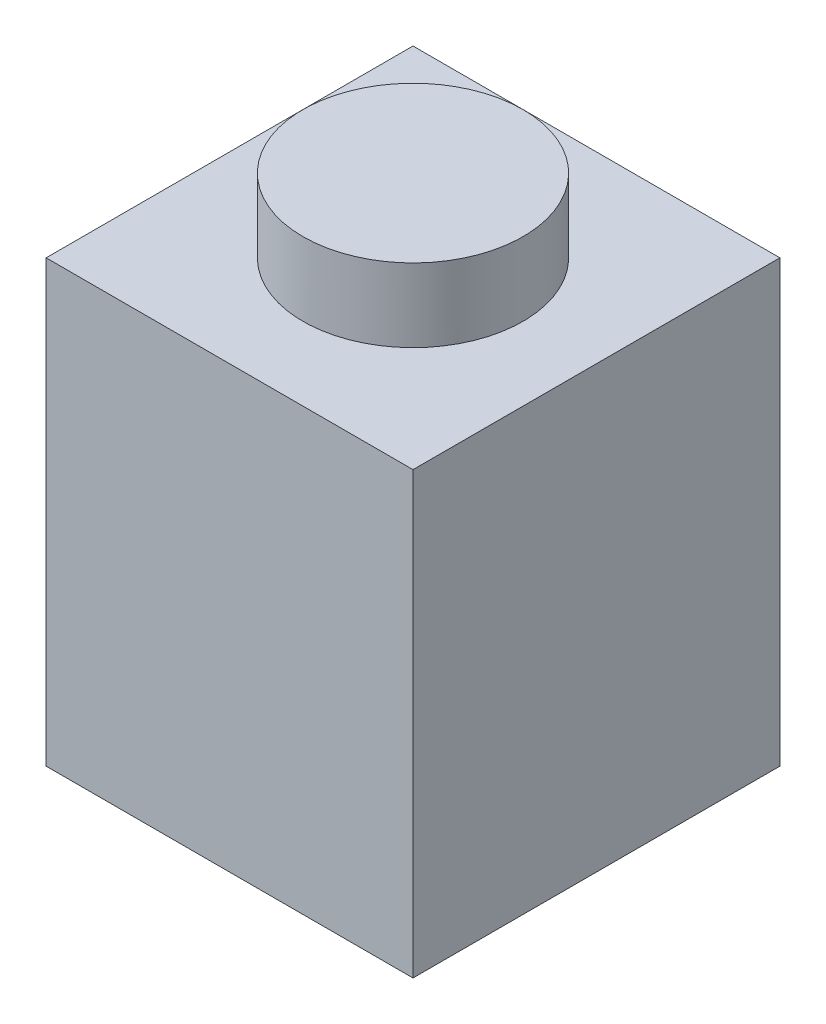
ISO-10303-21;
HEADER;
FILE_DESCRIPTION(('STEP AP214'),'2;1');
FILE_NAME('part.step','',(''),(''),'','','');
FILE_SCHEMA(('AUTOMOTIVE_DESIGN { 1 0 10303 214 1 1 1 1 }'));
ENDSEC;
DATA;
#1=APPLICATION_CONTEXT('core data for automotive mechanical design processes');
#2=APPLICATION_PROTOCOL_DEFINITION('international standard','automotive_design',2000,#1);
#3=PRODUCT_CONTEXT('',#1,'mechanical');
#4=PRODUCT('Part','Part','',(#3));
#5=PRODUCT_RELATED_PRODUCT_CATEGORY('part','',(#4));
#6=PRODUCT_DEFINITION_FORMATION('','',#4);
#7=PRODUCT_DEFINITION_CONTEXT('part definition',#1,'design');
#8=PRODUCT_DEFINITION('design','',#6,#7);
#9=PRODUCT_DEFINITION_SHAPE('','',#8);
#10=(LENGTH_UNIT() NAMED_UNIT(*) SI_UNIT(.MILLI.,.METRE.));
#11=(NAMED_UNIT(*) PLANE_ANGLE_UNIT() SI_UNIT($,.RADIAN.));
#12=(NAMED_UNIT(*) SI_UNIT($,.STERADIAN.) SOLID_ANGLE_UNIT());
#13=UNCERTAINTY_MEASURE_WITH_UNIT(LENGTH_MEASURE(1.E-05),#10,'distance_accuracy_value','');
#14=(GEOMETRIC_REPRESENTATION_CONTEXT(3) GLOBAL_UNCERTAINTY_ASSIGNED_CONTEXT((#13)) GLOBAL_UNIT_ASSIGNED_CONTEXT((#10,
#11,#12)) REPRESENTATION_CONTEXT('',''));
#15=CARTESIAN_POINT('',(0.,0.,0.));
#16=DIRECTION('',(0.,0.,1.));
#17=DIRECTION('',(1.,0.,0.));
#18=AXIS2_PLACEMENT_3D('',#15,#16,#17);
#19=CARTESIAN_POINT('',(1.,6.,-4.));
#20=DIRECTION('',(1.,0.,0.));
#21=DIRECTION('',(0.,0.,-1.));
#22=AXIS2_PLACEMENT_3D('',#19,#20,#21);
#23=PLANE('',#22);
#24=DIRECTION('',(0.,-1.,0.));
#25=VECTOR('',#24,1.);
#26=CARTESIAN_POINT('',(1.,6.,-4.));
#27=LINE('',#26,#25);
#28=CARTESIAN_POINT('',(1.,5.,-4.));
#29=VERTEX_POINT('',#28);
#30=CARTESIAN_POINT('',(1.,0.,-4.));
#31=VERTEX_POINT('',#30);
#32=EDGE_CURVE('E57',#29,#31,#27,.T.);
#33=ORIENTED_EDGE('',*,*,#32,.F.);
#34=DIRECTION('',(0.,0.,-1.));
#35=VECTOR('',#34,1.);
#36=CARTESIAN_POINT('',(1.,5.,500000.));
#37=LINE('',#36,#35);
#38=CARTESIAN_POINT('',(1.,5.,-0.999999999862666));
#39=VERTEX_POINT('',#38);
#40=EDGE_CURVE('E50',#39,#29,#37,.T.);
#41=ORIENTED_EDGE('',*,*,#40,.F.);
#42=DIRECTION('',(0.,-1.,0.));
#43=VECTOR('',#42,1.);
#44=CARTESIAN_POINT('',(1.,6.,-1.));
#45=LINE('',#44,#43);
#46=CARTESIAN_POINT('',(1.,0.,-1.));
#47=VERTEX_POINT('',#46);
#48=EDGE_CURVE('E109',#39,#47,#45,.T.);
#49=ORIENTED_EDGE('',*,*,#48,.T.);
#50=DIRECTION('',(0.,0.,1.));
#51=VECTOR('',#50,1.);
#52=CARTESIAN_POINT('',(1.,0.,-4.));
#53=LINE('',#52,#51);
#54=EDGE_CURVE('E224',#31,#47,#53,.T.);
#55=ORIENTED_EDGE('',*,*,#54,.F.);
#56=EDGE_LOOP('',(#33,#41,#49,#55));
#57=FACE_BOUND('',#56,.T.);
#58=ADVANCED_FACE('F35',(#57),#23,.T.);
#59=CARTESIAN_POINT('',(1.,6.,-1.));
#60=DIRECTION('',(0.,0.,-1.));
#61=DIRECTION('',(-1.,0.,0.));
#62=AXIS2_PLACEMENT_3D('',#59,#60,#61);
#63=PLANE('',#62);
#64=ORIENTED_EDGE('',*,*,#48,.F.);
#65=DIRECTION('',(-1.,0.,0.));
#66=VECTOR('',#65,1.);
#67=CARTESIAN_POINT('',(1.,5.,-0.999999999976353));
#68=LINE('',#67,#66);
#69=CARTESIAN_POINT('',(4.,5.,-0.999999999862666));
#70=VERTEX_POINT('',#69);
#71=EDGE_CURVE('E99',#70,#39,#68,.T.);
#72=ORIENTED_EDGE('',*,*,#71,.F.);
#73=DIRECTION('',(0.,-1.,0.));
#74=VECTOR('',#73,1.);
#75=CARTESIAN_POINT('',(4.,6.,-1.));
#76=LINE('',#75,#74);
#77=CARTESIAN_POINT('',(4.,0.,-1.));
#78=VERTEX_POINT('',#77);
#79=EDGE_CURVE('E117',#70,#78,#76,.T.);
#80=ORIENTED_EDGE('',*,*,#79,.T.);
#81=DIRECTION('',(1.,0.,0.));
#82=VECTOR('',#81,1.);
#83=CARTESIAN_POINT('',(1.,0.,-1.));
#84=LINE('',#83,#82);
#85=EDGE_CURVE('E114',#47,#78,#84,.T.);
#86=ORIENTED_EDGE('',*,*,#85,.F.);
#87=EDGE_LOOP('',(#64,#72,#80,#86));
#88=FACE_BOUND('',#87,.T.);
#89=ADVANCED_FACE('F112',(#88),#63,.T.);
#90=CARTESIAN_POINT('',(4.,6.,-4.));
#91=DIRECTION('',(-1.,0.,0.));
#92=DIRECTION('',(0.,0.,1.));
#93=AXIS2_PLACEMENT_3D('',#90,#91,#92);
#94=PLANE('',#93);
#95=ORIENTED_EDGE('',*,*,#79,.F.);
#96=DIRECTION('',(0.,0.,-1.));
#97=VECTOR('',#96,1.);
#98=CARTESIAN_POINT('',(4.,5.,500000.));
#99=LINE('',#98,#97);
#100=CARTESIAN_POINT('',(4.,5.,-4.));
#101=VERTEX_POINT('',#100);
#102=EDGE_CURVE('E102',#70,#101,#99,.T.);
#103=ORIENTED_EDGE('',*,*,#102,.T.);
#104=DIRECTION('',(0.,-1.,0.));
#105=VECTOR('',#104,1.);
#106=CARTESIAN_POINT('',(4.,6.,-4.));
#107=LINE('',#106,#105);
#108=CARTESIAN_POINT('',(4.,0.,-4.));
#109=VERTEX_POINT('',#108);
#110=EDGE_CURVE('E122',#101,#109,#107,.T.);
#111=ORIENTED_EDGE('',*,*,#110,.T.);
#112=DIRECTION('',(0.,0.,-1.));
#113=VECTOR('',#112,1.);
#114=CARTESIAN_POINT('',(4.,0.,-4.));
#115=LINE('',#114,#113);
#116=EDGE_CURVE('E229',#78,#109,#115,.T.);
#117=ORIENTED_EDGE('',*,*,#116,.F.);
#118=EDGE_LOOP('',(#95,#103,#111,#117));
#119=FACE_BOUND('',#118,.T.);
#120=ADVANCED_FACE('F180',(#119),#94,.T.);
#121=CARTESIAN_POINT('',(1.,6.,-4.));
#122=DIRECTION('',(0.,0.,1.));
#123=DIRECTION('',(1.,0.,0.));
#124=AXIS2_PLACEMENT_3D('',#121,#122,#123);
#125=PLANE('',#124);
#126=ORIENTED_EDGE('',*,*,#110,.F.);
#127=DIRECTION('',(1.,0.,0.));
#128=VECTOR('',#127,1.);
#129=CARTESIAN_POINT('',(1.,5.,-4.));
#130=LINE('',#129,#128);
#131=EDGE_CURVE('E223',#29,#101,#130,.T.);
#132=ORIENTED_EDGE('',*,*,#131,.F.);
#133=ORIENTED_EDGE('',*,*,#32,.T.);
#134=DIRECTION('',(-1.,0.,0.));
#135=VECTOR('',#134,1.);
#136=CARTESIAN_POINT('',(1.,0.,-4.));
#137=LINE('',#136,#135);
#138=EDGE_CURVE('E232',#109,#31,#137,.T.);
#139=ORIENTED_EDGE('',*,*,#138,.F.);
#140=EDGE_LOOP('',(#126,#132,#133,#139));
#141=FACE_BOUND('',#140,.T.);
#142=ADVANCED_FACE('F172',(#141),#125,.T.);
#143=CARTESIAN_POINT('',(0.,6.,0.));
#144=DIRECTION('',(0.,-1.,0.));
#145=DIRECTION('',(0.,0.,-1.));
#146=AXIS2_PLACEMENT_3D('',#143,#144,#145);
#147=PLANE('',#146);
#148=CARTESIAN_POINT('',(2.5,6.,-2.5));
#149=DIRECTION('',(0.,-1.,0.));
#150=DIRECTION('',(0.,0.,-1.));
#151=AXIS2_PLACEMENT_3D('',#148,#149,#150);
#152=CIRCLE('',#151,1.5);
#153=CARTESIAN_POINT('',(2.5,6.,-4.));
#154=VERTEX_POINT('',#153);
#155=EDGE_CURVE('E11',#154,#154,#152,.F.);
#156=ORIENTED_EDGE('',*,*,#155,.F.);
#157=EDGE_LOOP('',(#156));
#158=FACE_BOUND('',#157,.T.);
#159=DIRECTION('',(0.,0.,1.));
#160=VECTOR('',#159,1.);
#161=CARTESIAN_POINT('',(0.,6.,0.));
#162=LINE('',#161,#160);
#163=CARTESIAN_POINT('',(0.,6.,-5.));
#164=VERTEX_POINT('',#163);
#165=CARTESIAN_POINT('',(0.,6.,0.));
#166=VERTEX_POINT('',#165);
#167=EDGE_CURVE('E126',#164,#166,#162,.T.);
#168=ORIENTED_EDGE('',*,*,#167,.T.);
#169=DIRECTION('',(1.,0.,0.));
#170=VECTOR('',#169,1.);
#171=CARTESIAN_POINT('',(0.,6.,0.));
#172=LINE('',#171,#170);
#173=CARTESIAN_POINT('',(5.,6.,0.));
#174=VERTEX_POINT('',#173);
#175=EDGE_CURVE('E129',#166,#174,#172,.T.);
#176=ORIENTED_EDGE('',*,*,#175,.T.);
#177=DIRECTION('',(0.,0.,-1.));
#178=VECTOR('',#177,1.);
#179=CARTESIAN_POINT('',(5.,6.,0.));
#180=LINE('',#179,#178);
#181=CARTESIAN_POINT('',(5.,6.,-5.));
#182=VERTEX_POINT('',#181);
#183=EDGE_CURVE('E132',#174,#182,#180,.T.);
#184=ORIENTED_EDGE('',*,*,#183,.T.);
#185=DIRECTION('',(-1.,0.,0.));
#186=VECTOR('',#185,1.);
#187=CARTESIAN_POINT('',(0.,6.,-5.));
#188=LINE('',#187,#186);
#189=EDGE_CURVE('E134',#182,#164,#188,.T.);
#190=ORIENTED_EDGE('',*,*,#189,.T.);
#191=EDGE_LOOP('',(#168,#176,#184,#190));
#192=FACE_BOUND('',#191,.T.);
#193=ADVANCED_FACE('F170',(#158,#192),#147,.F.);
#194=CARTESIAN_POINT('',(0.,0.,0.));
#195=DIRECTION('',(0.,-1.,0.));
#196=DIRECTION('',(0.,0.,-1.));
#197=AXIS2_PLACEMENT_3D('',#194,#195,#196);
#198=PLANE('',#197);
#199=DIRECTION('',(0.,0.,1.));
#200=VECTOR('',#199,1.);
#201=CARTESIAN_POINT('',(0.,0.,0.));
#202=LINE('',#201,#200);
#203=CARTESIAN_POINT('',(0.,0.,-5.));
#204=VERTEX_POINT('',#203);
#205=CARTESIAN_POINT('',(0.,0.,0.));
#206=VERTEX_POINT('',#205);
#207=EDGE_CURVE('E116',#204,#206,#202,.T.);
#208=ORIENTED_EDGE('',*,*,#207,.F.);
#209=DIRECTION('',(-1.,0.,0.));
#210=VECTOR('',#209,1.);
#211=CARTESIAN_POINT('',(0.,0.,-5.));
#212=LINE('',#211,#210);
#213=CARTESIAN_POINT('',(5.,0.,-5.));
#214=VERTEX_POINT('',#213);
#215=EDGE_CURVE('E130',#214,#204,#212,.T.);
#216=ORIENTED_EDGE('',*,*,#215,.F.);
#217=DIRECTION('',(0.,0.,-1.));
#218=VECTOR('',#217,1.);
#219=CARTESIAN_POINT('',(5.,0.,0.));
#220=LINE('',#219,#218);
#221=CARTESIAN_POINT('',(5.,0.,0.));
#222=VERTEX_POINT('',#221);
#223=EDGE_CURVE('E138',#222,#214,#220,.T.);
#224=ORIENTED_EDGE('',*,*,#223,.F.);
#225=DIRECTION('',(1.,0.,0.));
#226=VECTOR('',#225,1.);
#227=CARTESIAN_POINT('',(0.,0.,0.));
#228=LINE('',#227,#226);
#229=EDGE_CURVE('E120',#206,#222,#228,.T.);
#230=ORIENTED_EDGE('',*,*,#229,.F.);
#231=EDGE_LOOP('',(#208,#216,#224,#230));
#232=FACE_BOUND('',#231,.T.);
#233=ORIENTED_EDGE('',*,*,#138,.T.);
#234=ORIENTED_EDGE('',*,*,#54,.T.);
#235=ORIENTED_EDGE('',*,*,#85,.T.);
#236=ORIENTED_EDGE('',*,*,#116,.T.);
#237=EDGE_LOOP('',(#233,#234,#235,#236));
#238=FACE_BOUND('',#237,.T.);
#239=ADVANCED_FACE('F159',(#232,#238),#198,.T.);
#240=CARTESIAN_POINT('',(0.,6.,0.));
#241=DIRECTION('',(1.,0.,0.));
#242=DIRECTION('',(0.,0.,-1.));
#243=AXIS2_PLACEMENT_3D('',#240,#241,#242);
#244=PLANE('',#243);
#245=ORIENTED_EDGE('',*,*,#207,.T.);
#246=DIRECTION('',(0.,-1.,0.));
#247=VECTOR('',#246,1.);
#248=CARTESIAN_POINT('',(0.,6.,0.));
#249=LINE('',#248,#247);
#250=EDGE_CURVE('E43',#166,#206,#249,.T.);
#251=ORIENTED_EDGE('',*,*,#250,.F.);
#252=ORIENTED_EDGE('',*,*,#167,.F.);
#253=DIRECTION('',(0.,-1.,0.));
#254=VECTOR('',#253,1.);
#255=CARTESIAN_POINT('',(0.,6.,-5.));
#256=LINE('',#255,#254);
#257=EDGE_CURVE('E135',#164,#204,#256,.T.);
#258=ORIENTED_EDGE('',*,*,#257,.T.);
#259=EDGE_LOOP('',(#245,#251,#252,#258));
#260=FACE_BOUND('',#259,.T.);
#261=ADVANCED_FACE('F37',(#260),#244,.F.);
#262=CARTESIAN_POINT('',(0.,6.,0.));
#263=DIRECTION('',(0.,0.,-1.));
#264=DIRECTION('',(-1.,0.,0.));
#265=AXIS2_PLACEMENT_3D('',#262,#263,#264);
#266=PLANE('',#265);
#267=ORIENTED_EDGE('',*,*,#229,.T.);
#268=DIRECTION('',(0.,-1.,0.));
#269=VECTOR('',#268,1.);
#270=CARTESIAN_POINT('',(5.,6.,0.));
#271=LINE('',#270,#269);
#272=EDGE_CURVE('E146',#174,#222,#271,.T.);
#273=ORIENTED_EDGE('',*,*,#272,.F.);
#274=ORIENTED_EDGE('',*,*,#175,.F.);
#275=ORIENTED_EDGE('',*,*,#250,.T.);
#276=EDGE_LOOP('',(#267,#273,#274,#275));
#277=FACE_BOUND('',#276,.T.);
#278=ADVANCED_FACE('F151',(#277),#266,.F.);
#279=CARTESIAN_POINT('',(5.,6.,0.));
#280=DIRECTION('',(-1.,0.,0.));
#281=DIRECTION('',(0.,0.,1.));
#282=AXIS2_PLACEMENT_3D('',#279,#280,#281);
#283=PLANE('',#282);
#284=ORIENTED_EDGE('',*,*,#223,.T.);
#285=DIRECTION('',(0.,-1.,0.));
#286=VECTOR('',#285,1.);
#287=CARTESIAN_POINT('',(5.,6.,-5.));
#288=LINE('',#287,#286);
#289=EDGE_CURVE('E143',#182,#214,#288,.T.);
#290=ORIENTED_EDGE('',*,*,#289,.F.);
#291=ORIENTED_EDGE('',*,*,#183,.F.);
#292=ORIENTED_EDGE('',*,*,#272,.T.);
#293=EDGE_LOOP('',(#284,#290,#291,#292));
#294=FACE_BOUND('',#293,.T.);
#295=ADVANCED_FACE('F164',(#294),#283,.F.);
#296=CARTESIAN_POINT('',(0.,6.,-5.));
#297=DIRECTION('',(0.,0.,1.));
#298=DIRECTION('',(1.,0.,0.));
#299=AXIS2_PLACEMENT_3D('',#296,#297,#298);
#300=PLANE('',#299);
#301=ORIENTED_EDGE('',*,*,#215,.T.);
#302=ORIENTED_EDGE('',*,*,#257,.F.);
#303=ORIENTED_EDGE('',*,*,#189,.F.);
#304=ORIENTED_EDGE('',*,*,#289,.T.);
#305=EDGE_LOOP('',(#301,#302,#303,#304));
#306=FACE_BOUND('',#305,.T.);
#307=ADVANCED_FACE('F168',(#306),#300,.F.);
#308=CARTESIAN_POINT('',(1.,5.,500000.));
#309=DIRECTION('',(0.,1.,0.));
#310=DIRECTION('',(0.,0.,1.));
#311=AXIS2_PLACEMENT_3D('',#308,#309,#310);
#312=PLANE('',#311);
#313=CARTESIAN_POINT('',(2.49999999993133,5.,-2.49999999993133));
#314=DIRECTION('',(0.,-1.,0.));
#315=DIRECTION('',(0.,0.,-1.));
#316=AXIS2_PLACEMENT_3D('',#313,#314,#315);
#317=CIRCLE('',#316,0.750000000065666);
#318=CARTESIAN_POINT('',(2.49999999993133,5.,-3.249999999997));
#319=VERTEX_POINT('',#318);
#320=EDGE_CURVE('E216',#319,#319,#317,.T.);
#321=ORIENTED_EDGE('',*,*,#320,.F.);
#322=EDGE_LOOP('',(#321));
#323=FACE_BOUND('',#322,.T.);
#324=ORIENTED_EDGE('',*,*,#102,.F.);
#325=ORIENTED_EDGE('',*,*,#71,.T.);
#326=ORIENTED_EDGE('',*,*,#40,.T.);
#327=ORIENTED_EDGE('',*,*,#131,.T.);
#328=EDGE_LOOP('',(#324,#325,#326,#327));
#329=FACE_BOUND('',#328,.T.);
#330=ADVANCED_FACE('F100',(#323,#329),#312,.F.);
#331=CARTESIAN_POINT('',(2.5,7.,-2.5));
#332=DIRECTION('',(0.,-1.,0.));
#333=DIRECTION('',(0.,0.,-1.));
#334=AXIS2_PLACEMENT_3D('',#331,#332,#333);
#335=CYLINDRICAL_SURFACE('',#334,1.5);
#336=CARTESIAN_POINT('',(2.5,7.,-2.5));
#337=DIRECTION('',(0.,1.,0.));
#338=DIRECTION('',(0.,0.,1.));
#339=AXIS2_PLACEMENT_3D('',#336,#337,#338);
#340=CIRCLE('',#339,1.5);
#341=CARTESIAN_POINT('',(2.5,7.,-1.));
#342=VERTEX_POINT('',#341);
#343=EDGE_CURVE('E106',#342,#342,#340,.T.);
#344=ORIENTED_EDGE('',*,*,#343,.F.);
#345=EDGE_LOOP('',(#344));
#346=FACE_BOUND('',#345,.T.);
#347=ORIENTED_EDGE('',*,*,#155,.T.);
#348=EDGE_LOOP('',(#347));
#349=FACE_BOUND('',#348,.T.);
#350=ADVANCED_FACE('F195',(#346,#349),#335,.T.);
#351=CARTESIAN_POINT('',(0.,7.,0.));
#352=DIRECTION('',(0.,1.,0.));
#353=DIRECTION('',(0.,0.,1.));
#354=AXIS2_PLACEMENT_3D('',#351,#352,#353);
#355=PLANE('',#354);
#356=ORIENTED_EDGE('',*,*,#343,.T.);
#357=EDGE_LOOP('',(#356));
#358=FACE_BOUND('',#357,.T.);
#359=ADVANCED_FACE('F199',(#358),#355,.T.);
#360=CARTESIAN_POINT('',(2.49999999993133,6.,-2.49999999993133));
#361=DIRECTION('',(0.,-1.,0.));
#362=DIRECTION('',(0.,0.,-1.));
#363=AXIS2_PLACEMENT_3D('',#360,#361,#362);
#364=CYLINDRICAL_SURFACE('',#363,0.750000000065666);
#365=CARTESIAN_POINT('',(2.49999999993133,6.,-2.49999999993133));
#366=DIRECTION('',(0.,-1.,0.));
#367=DIRECTION('',(0.,0.,-1.));
#368=AXIS2_PLACEMENT_3D('',#365,#366,#367);
#369=CIRCLE('',#368,0.750000000065666);
#370=CARTESIAN_POINT('',(2.49999999993133,6.,-3.249999999997));
#371=VERTEX_POINT('',#370);
#372=EDGE_CURVE('E215',#371,#371,#369,.T.);
#373=ORIENTED_EDGE('',*,*,#372,.F.);
#374=EDGE_LOOP('',(#373));
#375=FACE_BOUND('',#374,.T.);
#376=ORIENTED_EDGE('',*,*,#320,.T.);
#377=EDGE_LOOP('',(#376));
#378=FACE_BOUND('',#377,.T.);
#379=ADVANCED_FACE('F203',(#375,#378),#364,.F.);
#380=CARTESIAN_POINT('',(0.,6.,0.));
#381=DIRECTION('',(0.,-1.,0.));
#382=DIRECTION('',(0.,0.,-1.));
#383=AXIS2_PLACEMENT_3D('',#380,#381,#382);
#384=PLANE('',#383);
#385=ORIENTED_EDGE('',*,*,#372,.T.);
#386=EDGE_LOOP('',(#385));
#387=FACE_BOUND('',#386,.T.);
#388=ADVANCED_FACE('F207',(#387),#384,.T.);
#389=CLOSED_SHELL('',(#58,#89,#120,#142,#193,#239,#261,#278,#295,#307,#330,#350,#359,#379,#388));
#390=MANIFOLD_SOLID_BREP('B2',#389);
#391=ADVANCED_BREP_SHAPE_REPRESENTATION('',(#18,#390),#14);
#392=SHAPE_DEFINITION_REPRESENTATION(#9,#391);
ENDSEC;
END-ISO-10303-21;
